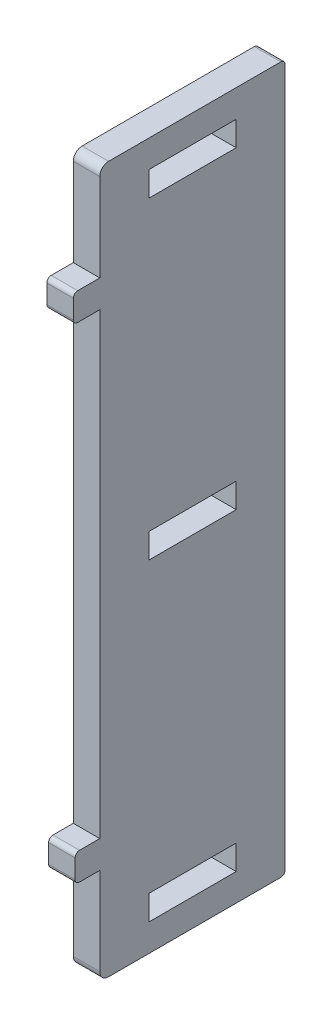
ISO-10303-21;
HEADER;
FILE_DESCRIPTION(('STEP AP214'),'2;1');
FILE_NAME('part.step','',(''),(''),'','','');
FILE_SCHEMA(('AUTOMOTIVE_DESIGN { 1 0 10303 214 1 1 1 1 }'));
ENDSEC;
DATA;
#1=APPLICATION_CONTEXT('core data for automotive mechanical design processes');
#2=APPLICATION_PROTOCOL_DEFINITION('international standard','automotive_design',2000,#1);
#3=PRODUCT_CONTEXT('',#1,'mechanical');
#4=PRODUCT('Part','Part','',(#3));
#5=PRODUCT_RELATED_PRODUCT_CATEGORY('part','',(#4));
#6=PRODUCT_DEFINITION_FORMATION('','',#4);
#7=PRODUCT_DEFINITION_CONTEXT('part definition',#1,'design');
#8=PRODUCT_DEFINITION('design','',#6,#7);
#9=PRODUCT_DEFINITION_SHAPE('','',#8);
#10=(LENGTH_UNIT() NAMED_UNIT(*) SI_UNIT(.MILLI.,.METRE.));
#11=(NAMED_UNIT(*) PLANE_ANGLE_UNIT() SI_UNIT($,.RADIAN.));
#12=(NAMED_UNIT(*) SI_UNIT($,.STERADIAN.) SOLID_ANGLE_UNIT());
#13=UNCERTAINTY_MEASURE_WITH_UNIT(LENGTH_MEASURE(1.E-05),#10,'distance_accuracy_value','');
#14=(GEOMETRIC_REPRESENTATION_CONTEXT(3) GLOBAL_UNCERTAINTY_ASSIGNED_CONTEXT((#13)) GLOBAL_UNIT_ASSIGNED_CONTEXT((#10,
#11,#12)) REPRESENTATION_CONTEXT('',''));
#15=CARTESIAN_POINT('',(0.,0.,0.));
#16=DIRECTION('',(0.,0.,1.));
#17=DIRECTION('',(1.,0.,0.));
#18=AXIS2_PLACEMENT_3D('',#15,#16,#17);
#19=CARTESIAN_POINT('',(3.,0.,13.3));
#20=DIRECTION('',(0.,0.,-1.));
#21=DIRECTION('',(0.,1.,0.));
#22=AXIS2_PLACEMENT_3D('',#19,#20,#21);
#23=PLANE('',#22);
#24=DIRECTION('',(0.,-1.,0.));
#25=VECTOR('',#24,1.);
#26=CARTESIAN_POINT('',(0.,0.,13.3));
#27=LINE('',#26,#25);
#28=CARTESIAN_POINT('',(0.,-26.44,13.3));
#29=VERTEX_POINT('',#28);
#30=CARTESIAN_POINT('',(0.,-28.56,13.3));
#31=VERTEX_POINT('',#30);
#32=EDGE_CURVE('E398',#29,#31,#27,.T.);
#33=ORIENTED_EDGE('',*,*,#32,.T.);
#34=DIRECTION('',(-1.,0.,0.));
#35=VECTOR('',#34,1.);
#36=CARTESIAN_POINT('',(3.,-28.56,13.3));
#37=LINE('',#36,#35);
#38=CARTESIAN_POINT('',(3.,-28.56,13.3));
#39=VERTEX_POINT('',#38);
#40=EDGE_CURVE('E55',#31,#39,#37,.F.);
#41=ORIENTED_EDGE('',*,*,#40,.T.);
#42=DIRECTION('',(0.,-1.,0.));
#43=VECTOR('',#42,1.);
#44=CARTESIAN_POINT('',(3.,0.,13.3));
#45=LINE('',#44,#43);
#46=CARTESIAN_POINT('',(3.,-26.44,13.3));
#47=VERTEX_POINT('',#46);
#48=EDGE_CURVE('E562',#47,#39,#45,.T.);
#49=ORIENTED_EDGE('',*,*,#48,.F.);
#50=DIRECTION('',(-1.,0.,0.));
#51=VECTOR('',#50,1.);
#52=CARTESIAN_POINT('',(0.,-26.44,13.3));
#53=LINE('',#52,#51);
#54=EDGE_CURVE('E608',#47,#29,#53,.T.);
#55=ORIENTED_EDGE('',*,*,#54,.T.);
#56=EDGE_LOOP('',(#33,#41,#49,#55));
#57=FACE_BOUND('',#56,.T.);
#58=ADVANCED_FACE('F46',(#57),#23,.F.);
#59=CARTESIAN_POINT('',(3.,-29.06,0.));
#60=DIRECTION('',(0.,1.,0.));
#61=DIRECTION('',(0.,0.,1.));
#62=AXIS2_PLACEMENT_3D('',#59,#60,#61);
#63=PLANE('',#62);
#64=DIRECTION('',(0.,0.,-1.));
#65=VECTOR('',#64,1.);
#66=CARTESIAN_POINT('',(3.,-29.06,0.));
#67=LINE('',#66,#65);
#68=CARTESIAN_POINT('',(3.,-29.06,12.8));
#69=VERTEX_POINT('',#68);
#70=CARTESIAN_POINT('',(3.,-29.06,10.5));
#71=VERTEX_POINT('',#70);
#72=EDGE_CURVE('E558',#69,#71,#67,.T.);
#73=ORIENTED_EDGE('',*,*,#72,.F.);
#74=DIRECTION('',(-1.,0.,0.));
#75=VECTOR('',#74,1.);
#76=CARTESIAN_POINT('',(3.,-29.06,12.8));
#77=LINE('',#76,#75);
#78=CARTESIAN_POINT('',(0.,-29.06,12.8));
#79=VERTEX_POINT('',#78);
#80=EDGE_CURVE('E604',#69,#79,#77,.T.);
#81=ORIENTED_EDGE('',*,*,#80,.T.);
#82=DIRECTION('',(0.,0.,-1.));
#83=VECTOR('',#82,1.);
#84=CARTESIAN_POINT('',(0.,-29.06,0.));
#85=LINE('',#84,#83);
#86=CARTESIAN_POINT('',(0.,-29.06,10.5));
#87=VERTEX_POINT('',#86);
#88=EDGE_CURVE('E401',#79,#87,#85,.T.);
#89=ORIENTED_EDGE('',*,*,#88,.T.);
#90=DIRECTION('',(-1.,0.,0.));
#91=VECTOR('',#90,1.);
#92=CARTESIAN_POINT('',(3.,-29.06,10.5));
#93=LINE('',#92,#91);
#94=EDGE_CURVE('E300',#71,#87,#93,.T.);
#95=ORIENTED_EDGE('',*,*,#94,.F.);
#96=EDGE_LOOP('',(#73,#81,#89,#95));
#97=FACE_BOUND('',#96,.T.);
#98=ADVANCED_FACE('F707',(#97),#63,.F.);
#99=CARTESIAN_POINT('',(3.,0.,10.5));
#100=DIRECTION('',(0.,0.,1.));
#101=DIRECTION('',(0.,-1.,0.));
#102=AXIS2_PLACEMENT_3D('',#99,#100,#101);
#103=PLANE('',#102);
#104=DIRECTION('',(0.,1.,0.));
#105=VECTOR('',#104,1.);
#106=CARTESIAN_POINT('',(0.,0.,10.5));
#107=LINE('',#106,#105);
#108=CARTESIAN_POINT('',(0.,-39.,10.5));
#109=VERTEX_POINT('',#108);
#110=EDGE_CURVE('E404',#109,#87,#107,.T.);
#111=ORIENTED_EDGE('',*,*,#110,.F.);
#112=DIRECTION('',(-1.,0.,0.));
#113=VECTOR('',#112,1.);
#114=CARTESIAN_POINT('',(3.,-39.,10.5));
#115=LINE('',#114,#113);
#116=CARTESIAN_POINT('',(3.,-39.,10.5));
#117=VERTEX_POINT('',#116);
#118=EDGE_CURVE('E306',#109,#117,#115,.F.);
#119=ORIENTED_EDGE('',*,*,#118,.T.);
#120=DIRECTION('',(0.,1.,0.));
#121=VECTOR('',#120,1.);
#122=CARTESIAN_POINT('',(3.,0.,10.5));
#123=LINE('',#122,#121);
#124=EDGE_CURVE('E561',#117,#71,#123,.T.);
#125=ORIENTED_EDGE('',*,*,#124,.T.);
#126=ORIENTED_EDGE('',*,*,#94,.T.);
#127=EDGE_LOOP('',(#111,#119,#125,#126));
#128=FACE_BOUND('',#127,.T.);
#129=ADVANCED_FACE('F713',(#128),#103,.T.);
#130=CARTESIAN_POINT('',(3.,-40.,0.));
#131=DIRECTION('',(0.,1.,0.));
#132=DIRECTION('',(0.,0.,1.));
#133=AXIS2_PLACEMENT_3D('',#130,#131,#132);
#134=PLANE('',#133);
#135=DIRECTION('',(0.,0.,-1.));
#136=VECTOR('',#135,1.);
#137=CARTESIAN_POINT('',(0.,-40.,0.));
#138=LINE('',#137,#136);
#139=CARTESIAN_POINT('',(0.,-40.,9.5));
#140=VERTEX_POINT('',#139);
#141=CARTESIAN_POINT('',(0.,-40.,-10.));
#142=VERTEX_POINT('',#141);
#143=EDGE_CURVE('E408',#140,#142,#138,.T.);
#144=ORIENTED_EDGE('',*,*,#143,.T.);
#145=DIRECTION('',(-1.,0.,0.));
#146=VECTOR('',#145,1.);
#147=CARTESIAN_POINT('',(3.,-40.,-10.));
#148=LINE('',#147,#146);
#149=CARTESIAN_POINT('',(3.,-40.,-10.));
#150=VERTEX_POINT('',#149);
#151=EDGE_CURVE('E585',#142,#150,#148,.F.);
#152=ORIENTED_EDGE('',*,*,#151,.T.);
#153=DIRECTION('',(0.,0.,-1.));
#154=VECTOR('',#153,1.);
#155=CARTESIAN_POINT('',(3.,-40.,0.));
#156=LINE('',#155,#154);
#157=CARTESIAN_POINT('',(3.,-40.,9.5));
#158=VERTEX_POINT('',#157);
#159=EDGE_CURVE('E569',#158,#150,#156,.T.);
#160=ORIENTED_EDGE('',*,*,#159,.F.);
#161=DIRECTION('',(-1.,0.,0.));
#162=VECTOR('',#161,1.);
#163=CARTESIAN_POINT('',(0.,-40.,9.5));
#164=LINE('',#163,#162);
#165=EDGE_CURVE('E295',#158,#140,#164,.T.);
#166=ORIENTED_EDGE('',*,*,#165,.T.);
#167=EDGE_LOOP('',(#144,#152,#160,#166));
#168=FACE_BOUND('',#167,.T.);
#169=ADVANCED_FACE('F721',(#168),#134,.F.);
#170=CARTESIAN_POINT('',(3.,0.,-10.5));
#171=DIRECTION('',(0.,0.,1.));
#172=DIRECTION('',(1.,0.,0.));
#173=AXIS2_PLACEMENT_3D('',#170,#171,#172);
#174=PLANE('',#173);
#175=DIRECTION('',(0.,1.,0.));
#176=VECTOR('',#175,1.);
#177=CARTESIAN_POINT('',(0.,0.,-10.5));
#178=LINE('',#177,#176);
#179=CARTESIAN_POINT('',(0.,-39.5,-10.5));
#180=VERTEX_POINT('',#179);
#181=CARTESIAN_POINT('',(0.,39.5,-10.5));
#182=VERTEX_POINT('',#181);
#183=EDGE_CURVE('E412',#180,#182,#178,.T.);
#184=ORIENTED_EDGE('',*,*,#183,.T.);
#185=DIRECTION('',(-1.,0.,0.));
#186=VECTOR('',#185,1.);
#187=CARTESIAN_POINT('',(3.,39.5,-10.5));
#188=LINE('',#187,#186);
#189=CARTESIAN_POINT('',(3.,39.5,-10.5));
#190=VERTEX_POINT('',#189);
#191=EDGE_CURVE('E539',#182,#190,#188,.F.);
#192=ORIENTED_EDGE('',*,*,#191,.T.);
#193=DIRECTION('',(0.,1.,0.));
#194=VECTOR('',#193,1.);
#195=CARTESIAN_POINT('',(3.,0.,-10.5));
#196=LINE('',#195,#194);
#197=CARTESIAN_POINT('',(3.,-39.5,-10.5));
#198=VERTEX_POINT('',#197);
#199=EDGE_CURVE('E573',#198,#190,#196,.T.);
#200=ORIENTED_EDGE('',*,*,#199,.F.);
#201=DIRECTION('',(-1.,0.,0.));
#202=VECTOR('',#201,1.);
#203=CARTESIAN_POINT('',(3.,-39.5,-10.5));
#204=LINE('',#203,#202);
#205=EDGE_CURVE('E535',#198,#180,#204,.T.);
#206=ORIENTED_EDGE('',*,*,#205,.T.);
#207=EDGE_LOOP('',(#184,#192,#200,#206));
#208=FACE_BOUND('',#207,.T.);
#209=ADVANCED_FACE('F729',(#208),#174,.F.);
#210=CARTESIAN_POINT('',(3.,40.,0.));
#211=DIRECTION('',(0.,1.,0.));
#212=DIRECTION('',(0.,0.,1.));
#213=AXIS2_PLACEMENT_3D('',#210,#211,#212);
#214=PLANE('',#213);
#215=DIRECTION('',(0.,0.,-1.));
#216=VECTOR('',#215,1.);
#217=CARTESIAN_POINT('',(3.,40.,0.));
#218=LINE('',#217,#216);
#219=CARTESIAN_POINT('',(3.,40.,9.5));
#220=VERTEX_POINT('',#219);
#221=CARTESIAN_POINT('',(3.,40.,-10.));
#222=VERTEX_POINT('',#221);
#223=EDGE_CURVE('E330',#220,#222,#218,.T.);
#224=ORIENTED_EDGE('',*,*,#223,.T.);
#225=DIRECTION('',(-1.,0.,0.));
#226=VECTOR('',#225,1.);
#227=CARTESIAN_POINT('',(0.,40.,-10.));
#228=LINE('',#227,#226);
#229=CARTESIAN_POINT('',(0.,40.,-10.));
#230=VERTEX_POINT('',#229);
#231=EDGE_CURVE('E505',#222,#230,#228,.T.);
#232=ORIENTED_EDGE('',*,*,#231,.T.);
#233=DIRECTION('',(0.,0.,-1.));
#234=VECTOR('',#233,1.);
#235=CARTESIAN_POINT('',(0.,40.,0.));
#236=LINE('',#235,#234);
#237=CARTESIAN_POINT('',(0.,40.,9.5));
#238=VERTEX_POINT('',#237);
#239=EDGE_CURVE('E416',#238,#230,#236,.T.);
#240=ORIENTED_EDGE('',*,*,#239,.F.);
#241=DIRECTION('',(-1.,0.,0.));
#242=VECTOR('',#241,1.);
#243=CARTESIAN_POINT('',(3.,40.,9.5));
#244=LINE('',#243,#242);
#245=EDGE_CURVE('E502',#238,#220,#244,.F.);
#246=ORIENTED_EDGE('',*,*,#245,.T.);
#247=EDGE_LOOP('',(#224,#232,#240,#246));
#248=FACE_BOUND('',#247,.T.);
#249=ADVANCED_FACE('F501',(#248),#214,.T.);
#250=CARTESIAN_POINT('',(3.,0.,10.5));
#251=DIRECTION('',(0.,0.,1.));
#252=DIRECTION('',(1.,0.,0.));
#253=AXIS2_PLACEMENT_3D('',#250,#251,#252);
#254=PLANE('',#253);
#255=DIRECTION('',(0.,1.,0.));
#256=VECTOR('',#255,1.);
#257=CARTESIAN_POINT('',(3.,0.,10.5));
#258=LINE('',#257,#256);
#259=CARTESIAN_POINT('',(3.,29.06,10.5));
#260=VERTEX_POINT('',#259);
#261=CARTESIAN_POINT('',(3.,39.,10.5));
#262=VERTEX_POINT('',#261);
#263=EDGE_CURVE('E325',#260,#262,#258,.T.);
#264=ORIENTED_EDGE('',*,*,#263,.T.);
#265=DIRECTION('',(-1.,0.,0.));
#266=VECTOR('',#265,1.);
#267=CARTESIAN_POINT('',(3.,39.,10.5));
#268=LINE('',#267,#266);
#269=CARTESIAN_POINT('',(0.,39.,10.5));
#270=VERTEX_POINT('',#269);
#271=EDGE_CURVE('E512',#262,#270,#268,.T.);
#272=ORIENTED_EDGE('',*,*,#271,.T.);
#273=DIRECTION('',(0.,1.,0.));
#274=VECTOR('',#273,1.);
#275=CARTESIAN_POINT('',(0.,0.,10.5));
#276=LINE('',#275,#274);
#277=CARTESIAN_POINT('',(0.,29.06,10.5));
#278=VERTEX_POINT('',#277);
#279=EDGE_CURVE('E420',#278,#270,#276,.T.);
#280=ORIENTED_EDGE('',*,*,#279,.F.);
#281=DIRECTION('',(-1.,0.,0.));
#282=VECTOR('',#281,1.);
#283=CARTESIAN_POINT('',(3.,29.06,10.5));
#284=LINE('',#283,#282);
#285=EDGE_CURVE('E446',#260,#278,#284,.T.);
#286=ORIENTED_EDGE('',*,*,#285,.F.);
#287=EDGE_LOOP('',(#264,#272,#280,#286));
#288=FACE_BOUND('',#287,.T.);
#289=ADVANCED_FACE('F638',(#288),#254,.T.);
#290=CARTESIAN_POINT('',(3.,29.06,0.));
#291=DIRECTION('',(0.,1.,0.));
#292=DIRECTION('',(0.,0.,1.));
#293=AXIS2_PLACEMENT_3D('',#290,#291,#292);
#294=PLANE('',#293);
#295=DIRECTION('',(0.,0.,-1.));
#296=VECTOR('',#295,1.);
#297=CARTESIAN_POINT('',(0.,29.06,0.));
#298=LINE('',#297,#296);
#299=CARTESIAN_POINT('',(0.,29.06,13.));
#300=VERTEX_POINT('',#299);
#301=EDGE_CURVE('E424',#300,#278,#298,.T.);
#302=ORIENTED_EDGE('',*,*,#301,.F.);
#303=DIRECTION('',(-1.,0.,0.));
#304=VECTOR('',#303,1.);
#305=CARTESIAN_POINT('',(3.,29.06,13.));
#306=LINE('',#305,#304);
#307=CARTESIAN_POINT('',(3.,29.06,13.));
#308=VERTEX_POINT('',#307);
#309=EDGE_CURVE('E601',#300,#308,#306,.F.);
#310=ORIENTED_EDGE('',*,*,#309,.T.);
#311=DIRECTION('',(0.,0.,-1.));
#312=VECTOR('',#311,1.);
#313=CARTESIAN_POINT('',(3.,29.06,0.));
#314=LINE('',#313,#312);
#315=EDGE_CURVE('E329',#308,#260,#314,.T.);
#316=ORIENTED_EDGE('',*,*,#315,.T.);
#317=ORIENTED_EDGE('',*,*,#285,.T.);
#318=EDGE_LOOP('',(#302,#310,#316,#317));
#319=FACE_BOUND('',#318,.T.);
#320=ADVANCED_FACE('F634',(#319),#294,.T.);
#321=CARTESIAN_POINT('',(3.,0.,13.5));
#322=DIRECTION('',(0.,0.,-1.));
#323=DIRECTION('',(-1.,0.,0.));
#324=AXIS2_PLACEMENT_3D('',#321,#322,#323);
#325=PLANE('',#324);
#326=DIRECTION('',(0.,-1.,0.));
#327=VECTOR('',#326,1.);
#328=CARTESIAN_POINT('',(0.,0.,13.5));
#329=LINE('',#328,#327);
#330=CARTESIAN_POINT('',(0.,28.56,13.5));
#331=VERTEX_POINT('',#330);
#332=CARTESIAN_POINT('',(0.,26.44,13.5));
#333=VERTEX_POINT('',#332);
#334=EDGE_CURVE('E428',#331,#333,#329,.T.);
#335=ORIENTED_EDGE('',*,*,#334,.T.);
#336=DIRECTION('',(-1.,0.,0.));
#337=VECTOR('',#336,1.);
#338=CARTESIAN_POINT('',(3.,26.44,13.5));
#339=LINE('',#338,#337);
#340=CARTESIAN_POINT('',(3.,26.44,13.5));
#341=VERTEX_POINT('',#340);
#342=EDGE_CURVE('E598',#333,#341,#339,.F.);
#343=ORIENTED_EDGE('',*,*,#342,.T.);
#344=DIRECTION('',(0.,-1.,0.));
#345=VECTOR('',#344,1.);
#346=CARTESIAN_POINT('',(3.,0.,13.5));
#347=LINE('',#346,#345);
#348=CARTESIAN_POINT('',(3.,28.56,13.5));
#349=VERTEX_POINT('',#348);
#350=EDGE_CURVE('E620',#349,#341,#347,.T.);
#351=ORIENTED_EDGE('',*,*,#350,.F.);
#352=DIRECTION('',(-1.,0.,0.));
#353=VECTOR('',#352,1.);
#354=CARTESIAN_POINT('',(0.,28.56,13.5));
#355=LINE('',#354,#353);
#356=EDGE_CURVE('E594',#349,#331,#355,.T.);
#357=ORIENTED_EDGE('',*,*,#356,.T.);
#358=EDGE_LOOP('',(#335,#343,#351,#357));
#359=FACE_BOUND('',#358,.T.);
#360=ADVANCED_FACE('F627',(#359),#325,.F.);
#361=CARTESIAN_POINT('',(3.,25.94,0.));
#362=DIRECTION('',(0.,1.,0.));
#363=DIRECTION('',(0.,0.,1.));
#364=AXIS2_PLACEMENT_3D('',#361,#362,#363);
#365=PLANE('',#364);
#366=DIRECTION('',(0.,0.,-1.));
#367=VECTOR('',#366,1.);
#368=CARTESIAN_POINT('',(3.,25.94,0.));
#369=LINE('',#368,#367);
#370=CARTESIAN_POINT('',(3.,25.94,13.));
#371=VERTEX_POINT('',#370);
#372=CARTESIAN_POINT('',(3.,25.94,10.5));
#373=VERTEX_POINT('',#372);
#374=EDGE_CURVE('E351',#371,#373,#369,.T.);
#375=ORIENTED_EDGE('',*,*,#374,.F.);
#376=DIRECTION('',(-1.,0.,0.));
#377=VECTOR('',#376,1.);
#378=CARTESIAN_POINT('',(3.,25.94,13.));
#379=LINE('',#378,#377);
#380=CARTESIAN_POINT('',(0.,25.94,13.));
#381=VERTEX_POINT('',#380);
#382=EDGE_CURVE('E590',#371,#381,#379,.T.);
#383=ORIENTED_EDGE('',*,*,#382,.T.);
#384=DIRECTION('',(0.,0.,-1.));
#385=VECTOR('',#384,1.);
#386=CARTESIAN_POINT('',(0.,25.94,0.));
#387=LINE('',#386,#385);
#388=CARTESIAN_POINT('',(0.,25.94,10.5));
#389=VERTEX_POINT('',#388);
#390=EDGE_CURVE('E432',#381,#389,#387,.T.);
#391=ORIENTED_EDGE('',*,*,#390,.T.);
#392=DIRECTION('',(-1.,0.,0.));
#393=VECTOR('',#392,1.);
#394=CARTESIAN_POINT('',(3.,25.94,10.5));
#395=LINE('',#394,#393);
#396=EDGE_CURVE('E441',#373,#389,#395,.T.);
#397=ORIENTED_EDGE('',*,*,#396,.F.);
#398=EDGE_LOOP('',(#375,#383,#391,#397));
#399=FACE_BOUND('',#398,.T.);
#400=ADVANCED_FACE('F689',(#399),#365,.F.);
#401=CARTESIAN_POINT('',(0.,-25.94,10.5));
#402=VERTEX_POINT('',#401);
#403=EDGE_CURVE('E425',#402,#389,#276,.T.);
#404=ORIENTED_EDGE('',*,*,#403,.F.);
#405=DIRECTION('',(-1.,0.,0.));
#406=VECTOR('',#405,1.);
#407=CARTESIAN_POINT('',(3.,-25.94,10.5));
#408=LINE('',#407,#406);
#409=CARTESIAN_POINT('',(3.,-25.94,10.5));
#410=VERTEX_POINT('',#409);
#411=EDGE_CURVE('E437',#410,#402,#408,.T.);
#412=ORIENTED_EDGE('',*,*,#411,.F.);
#413=EDGE_CURVE('E331',#410,#373,#258,.T.);
#414=ORIENTED_EDGE('',*,*,#413,.T.);
#415=ORIENTED_EDGE('',*,*,#396,.T.);
#416=EDGE_LOOP('',(#404,#412,#414,#415));
#417=FACE_BOUND('',#416,.T.);
#418=ADVANCED_FACE('F683',(#417),#254,.T.);
#419=CARTESIAN_POINT('',(3.,-34.1,0.));
#420=DIRECTION('',(0.,1.,0.));
#421=DIRECTION('',(0.,0.,1.));
#422=AXIS2_PLACEMENT_3D('',#419,#420,#421);
#423=PLANE('',#422);
#424=DIRECTION('',(0.,0.,-1.));
#425=VECTOR('',#424,1.);
#426=CARTESIAN_POINT('',(0.,-34.1,0.));
#427=LINE('',#426,#425);
#428=CARTESIAN_POINT('',(0.,-34.1,4.95));
#429=VERTEX_POINT('',#428);
#430=CARTESIAN_POINT('',(0.,-34.1,-4.95));
#431=VERTEX_POINT('',#430);
#432=EDGE_CURVE('E382',#429,#431,#427,.T.);
#433=ORIENTED_EDGE('',*,*,#432,.T.);
#434=DIRECTION('',(-1.,0.,0.));
#435=VECTOR('',#434,1.);
#436=CARTESIAN_POINT('',(3.,-34.1,-4.95));
#437=LINE('',#436,#435);
#438=CARTESIAN_POINT('',(3.,-34.1,-4.95));
#439=VERTEX_POINT('',#438);
#440=EDGE_CURVE('E442',#439,#431,#437,.T.);
#441=ORIENTED_EDGE('',*,*,#440,.F.);
#442=DIRECTION('',(0.,0.,-1.));
#443=VECTOR('',#442,1.);
#444=CARTESIAN_POINT('',(3.,-34.1,0.));
#445=LINE('',#444,#443);
#446=CARTESIAN_POINT('',(3.,-34.1,4.95));
#447=VERTEX_POINT('',#446);
#448=EDGE_CURVE('E653',#447,#439,#445,.T.);
#449=ORIENTED_EDGE('',*,*,#448,.F.);
#450=DIRECTION('',(-1.,0.,0.));
#451=VECTOR('',#450,1.);
#452=CARTESIAN_POINT('',(3.,-34.1,4.95));
#453=LINE('',#452,#451);
#454=EDGE_CURVE('E453',#447,#429,#453,.T.);
#455=ORIENTED_EDGE('',*,*,#454,.T.);
#456=EDGE_LOOP('',(#433,#441,#449,#455));
#457=FACE_BOUND('',#456,.T.);
#458=ADVANCED_FACE('F762',(#457),#423,.F.);
#459=CARTESIAN_POINT('',(3.,0.,-4.95));
#460=DIRECTION('',(0.,0.,-1.));
#461=DIRECTION('',(-1.,0.,0.));
#462=AXIS2_PLACEMENT_3D('',#459,#460,#461);
#463=PLANE('',#462);
#464=DIRECTION('',(0.,-1.,0.));
#465=VECTOR('',#464,1.);
#466=CARTESIAN_POINT('',(0.,0.,-4.95));
#467=LINE('',#466,#465);
#468=CARTESIAN_POINT('',(0.,-36.9,-4.95));
#469=VERTEX_POINT('',#468);
#470=EDGE_CURVE('E386',#431,#469,#467,.T.);
#471=ORIENTED_EDGE('',*,*,#470,.T.);
#472=DIRECTION('',(-1.,0.,0.));
#473=VECTOR('',#472,1.);
#474=CARTESIAN_POINT('',(3.,-36.9,-4.95));
#475=LINE('',#474,#473);
#476=CARTESIAN_POINT('',(3.,-36.9,-4.95));
#477=VERTEX_POINT('',#476);
#478=EDGE_CURVE('E460',#477,#469,#475,.T.);
#479=ORIENTED_EDGE('',*,*,#478,.F.);
#480=DIRECTION('',(0.,-1.,0.));
#481=VECTOR('',#480,1.);
#482=CARTESIAN_POINT('',(3.,0.,-4.95));
#483=LINE('',#482,#481);
#484=EDGE_CURVE('E650',#439,#477,#483,.T.);
#485=ORIENTED_EDGE('',*,*,#484,.F.);
#486=ORIENTED_EDGE('',*,*,#440,.T.);
#487=EDGE_LOOP('',(#471,#479,#485,#486));
#488=FACE_BOUND('',#487,.T.);
#489=ADVANCED_FACE('F758',(#488),#463,.F.);
#490=CARTESIAN_POINT('',(3.,-36.9,0.));
#491=DIRECTION('',(0.,1.,0.));
#492=DIRECTION('',(0.,0.,1.));
#493=AXIS2_PLACEMENT_3D('',#490,#491,#492);
#494=PLANE('',#493);
#495=DIRECTION('',(0.,0.,-1.));
#496=VECTOR('',#495,1.);
#497=CARTESIAN_POINT('',(0.,-36.9,0.));
#498=LINE('',#497,#496);
#499=CARTESIAN_POINT('',(0.,-36.9,4.95));
#500=VERTEX_POINT('',#499);
#501=EDGE_CURVE('E390',#500,#469,#498,.T.);
#502=ORIENTED_EDGE('',*,*,#501,.F.);
#503=DIRECTION('',(-1.,0.,0.));
#504=VECTOR('',#503,1.);
#505=CARTESIAN_POINT('',(3.,-36.9,4.95));
#506=LINE('',#505,#504);
#507=CARTESIAN_POINT('',(3.,-36.9,4.95));
#508=VERTEX_POINT('',#507);
#509=EDGE_CURVE('E456',#508,#500,#506,.T.);
#510=ORIENTED_EDGE('',*,*,#509,.F.);
#511=DIRECTION('',(0.,0.,-1.));
#512=VECTOR('',#511,1.);
#513=CARTESIAN_POINT('',(3.,-36.9,0.));
#514=LINE('',#513,#512);
#515=EDGE_CURVE('E647',#508,#477,#514,.T.);
#516=ORIENTED_EDGE('',*,*,#515,.T.);
#517=ORIENTED_EDGE('',*,*,#478,.T.);
#518=EDGE_LOOP('',(#502,#510,#516,#517));
#519=FACE_BOUND('',#518,.T.);
#520=ADVANCED_FACE('F754',(#519),#494,.T.);
#521=CARTESIAN_POINT('',(3.,1.4,0.));
#522=DIRECTION('',(0.,1.,0.));
#523=DIRECTION('',(0.,0.,1.));
#524=AXIS2_PLACEMENT_3D('',#521,#522,#523);
#525=PLANE('',#524);
#526=DIRECTION('',(0.,0.,-1.));
#527=VECTOR('',#526,1.);
#528=CARTESIAN_POINT('',(0.,1.4,0.));
#529=LINE('',#528,#527);
#530=CARTESIAN_POINT('',(0.,1.4,4.95));
#531=VERTEX_POINT('',#530);
#532=CARTESIAN_POINT('',(0.,1.4,-4.95));
#533=VERTEX_POINT('',#532);
#534=EDGE_CURVE('E366',#531,#533,#529,.T.);
#535=ORIENTED_EDGE('',*,*,#534,.T.);
#536=DIRECTION('',(-1.,0.,0.));
#537=VECTOR('',#536,1.);
#538=CARTESIAN_POINT('',(3.,1.4,-4.95));
#539=LINE('',#538,#537);
#540=CARTESIAN_POINT('',(3.,1.4,-4.95));
#541=VERTEX_POINT('',#540);
#542=EDGE_CURVE('E457',#541,#533,#539,.T.);
#543=ORIENTED_EDGE('',*,*,#542,.F.);
#544=DIRECTION('',(0.,0.,-1.));
#545=VECTOR('',#544,1.);
#546=CARTESIAN_POINT('',(3.,1.4,0.));
#547=LINE('',#546,#545);
#548=CARTESIAN_POINT('',(3.,1.4,4.95));
#549=VERTEX_POINT('',#548);
#550=EDGE_CURVE('E668',#549,#541,#547,.T.);
#551=ORIENTED_EDGE('',*,*,#550,.F.);
#552=DIRECTION('',(-1.,0.,0.));
#553=VECTOR('',#552,1.);
#554=CARTESIAN_POINT('',(3.,1.4,4.95));
#555=LINE('',#554,#553);
#556=EDGE_CURVE('E285',#549,#531,#555,.T.);
#557=ORIENTED_EDGE('',*,*,#556,.T.);
#558=EDGE_LOOP('',(#535,#543,#551,#557));
#559=FACE_BOUND('',#558,.T.);
#560=ADVANCED_FACE('F757',(#559),#525,.F.);
#561=CARTESIAN_POINT('',(3.,0.,-4.95));
#562=DIRECTION('',(0.,0.,-1.));
#563=DIRECTION('',(-1.,0.,0.));
#564=AXIS2_PLACEMENT_3D('',#561,#562,#563);
#565=PLANE('',#564);
#566=DIRECTION('',(0.,-1.,0.));
#567=VECTOR('',#566,1.);
#568=CARTESIAN_POINT('',(0.,0.,-4.95));
#569=LINE('',#568,#567);
#570=CARTESIAN_POINT('',(0.,-1.4,-4.95));
#571=VERTEX_POINT('',#570);
#572=EDGE_CURVE('E370',#533,#571,#569,.T.);
#573=ORIENTED_EDGE('',*,*,#572,.T.);
#574=DIRECTION('',(-1.,0.,0.));
#575=VECTOR('',#574,1.);
#576=CARTESIAN_POINT('',(3.,-1.4,-4.95));
#577=LINE('',#576,#575);
#578=CARTESIAN_POINT('',(3.,-1.4,-4.95));
#579=VERTEX_POINT('',#578);
#580=EDGE_CURVE('E468',#579,#571,#577,.T.);
#581=ORIENTED_EDGE('',*,*,#580,.F.);
#582=DIRECTION('',(0.,-1.,0.));
#583=VECTOR('',#582,1.);
#584=CARTESIAN_POINT('',(3.,0.,-4.95));
#585=LINE('',#584,#583);
#586=EDGE_CURVE('E665',#541,#579,#585,.T.);
#587=ORIENTED_EDGE('',*,*,#586,.F.);
#588=ORIENTED_EDGE('',*,*,#542,.T.);
#589=EDGE_LOOP('',(#573,#581,#587,#588));
#590=FACE_BOUND('',#589,.T.);
#591=ADVANCED_FACE('F773',(#590),#565,.F.);
#592=CARTESIAN_POINT('',(3.,-1.4,0.));
#593=DIRECTION('',(0.,1.,0.));
#594=DIRECTION('',(0.,0.,1.));
#595=AXIS2_PLACEMENT_3D('',#592,#593,#594);
#596=PLANE('',#595);
#597=DIRECTION('',(0.,0.,-1.));
#598=VECTOR('',#597,1.);
#599=CARTESIAN_POINT('',(0.,-1.4,0.));
#600=LINE('',#599,#598);
#601=CARTESIAN_POINT('',(0.,-1.4,4.95));
#602=VERTEX_POINT('',#601);
#603=EDGE_CURVE('E374',#602,#571,#600,.T.);
#604=ORIENTED_EDGE('',*,*,#603,.F.);
#605=DIRECTION('',(-1.,0.,0.));
#606=VECTOR('',#605,1.);
#607=CARTESIAN_POINT('',(3.,-1.4,4.95));
#608=LINE('',#607,#606);
#609=CARTESIAN_POINT('',(3.,-1.4,4.95));
#610=VERTEX_POINT('',#609);
#611=EDGE_CURVE('E289',#610,#602,#608,.T.);
#612=ORIENTED_EDGE('',*,*,#611,.F.);
#613=DIRECTION('',(0.,0.,-1.));
#614=VECTOR('',#613,1.);
#615=CARTESIAN_POINT('',(3.,-1.4,0.));
#616=LINE('',#615,#614);
#617=EDGE_CURVE('E661',#610,#579,#616,.T.);
#618=ORIENTED_EDGE('',*,*,#617,.T.);
#619=ORIENTED_EDGE('',*,*,#580,.T.);
#620=EDGE_LOOP('',(#604,#612,#618,#619));
#621=FACE_BOUND('',#620,.T.);
#622=ADVANCED_FACE('F770',(#621),#596,.T.);
#623=CARTESIAN_POINT('',(3.,36.9,0.));
#624=DIRECTION('',(0.,1.,0.));
#625=DIRECTION('',(0.,0.,1.));
#626=AXIS2_PLACEMENT_3D('',#623,#624,#625);
#627=PLANE('',#626);
#628=DIRECTION('',(0.,0.,-1.));
#629=VECTOR('',#628,1.);
#630=CARTESIAN_POINT('',(0.,36.9,0.));
#631=LINE('',#630,#629);
#632=CARTESIAN_POINT('',(0.,36.9,4.95));
#633=VERTEX_POINT('',#632);
#634=CARTESIAN_POINT('',(0.,36.9,-4.95));
#635=VERTEX_POINT('',#634);
#636=EDGE_CURVE('E283',#633,#635,#631,.T.);
#637=ORIENTED_EDGE('',*,*,#636,.T.);
#638=DIRECTION('',(-1.,0.,0.));
#639=VECTOR('',#638,1.);
#640=CARTESIAN_POINT('',(3.,36.9,-4.95));
#641=LINE('',#640,#639);
#642=CARTESIAN_POINT('',(3.,36.9,-4.95));
#643=VERTEX_POINT('',#642);
#644=EDGE_CURVE('E261',#643,#635,#641,.T.);
#645=ORIENTED_EDGE('',*,*,#644,.F.);
#646=DIRECTION('',(0.,0.,-1.));
#647=VECTOR('',#646,1.);
#648=CARTESIAN_POINT('',(3.,36.9,0.));
#649=LINE('',#648,#647);
#650=CARTESIAN_POINT('',(3.,36.9,4.95));
#651=VERTEX_POINT('',#650);
#652=EDGE_CURVE('E269',#651,#643,#649,.T.);
#653=ORIENTED_EDGE('',*,*,#652,.F.);
#654=DIRECTION('',(-1.,0.,0.));
#655=VECTOR('',#654,1.);
#656=CARTESIAN_POINT('',(3.,36.9,4.95));
#657=LINE('',#656,#655);
#658=EDGE_CURVE('E350',#651,#633,#657,.T.);
#659=ORIENTED_EDGE('',*,*,#658,.T.);
#660=EDGE_LOOP('',(#637,#645,#653,#659));
#661=FACE_BOUND('',#660,.T.);
#662=ADVANCED_FACE('F281',(#661),#627,.F.);
#663=CARTESIAN_POINT('',(3.,0.,-4.95));
#664=DIRECTION('',(0.,0.,-1.));
#665=DIRECTION('',(-1.,0.,0.));
#666=AXIS2_PLACEMENT_3D('',#663,#664,#665);
#667=PLANE('',#666);
#668=DIRECTION('',(0.,-1.,0.));
#669=VECTOR('',#668,1.);
#670=CARTESIAN_POINT('',(0.,0.,-4.95));
#671=LINE('',#670,#669);
#672=CARTESIAN_POINT('',(0.,34.1,-4.95));
#673=VERTEX_POINT('',#672);
#674=EDGE_CURVE('E355',#635,#673,#671,.T.);
#675=ORIENTED_EDGE('',*,*,#674,.T.);
#676=DIRECTION('',(-1.,0.,0.));
#677=VECTOR('',#676,1.);
#678=CARTESIAN_POINT('',(3.,34.1,-4.95));
#679=LINE('',#678,#677);
#680=CARTESIAN_POINT('',(3.,34.1,-4.95));
#681=VERTEX_POINT('',#680);
#682=EDGE_CURVE('E263',#681,#673,#679,.T.);
#683=ORIENTED_EDGE('',*,*,#682,.F.);
#684=DIRECTION('',(0.,-1.,0.));
#685=VECTOR('',#684,1.);
#686=CARTESIAN_POINT('',(3.,0.,-4.95));
#687=LINE('',#686,#685);
#688=EDGE_CURVE('E256',#643,#681,#687,.T.);
#689=ORIENTED_EDGE('',*,*,#688,.F.);
#690=ORIENTED_EDGE('',*,*,#644,.T.);
#691=EDGE_LOOP('',(#675,#683,#689,#690));
#692=FACE_BOUND('',#691,.T.);
#693=ADVANCED_FACE('F259',(#692),#667,.F.);
#694=CARTESIAN_POINT('',(3.,34.1,0.));
#695=DIRECTION('',(0.,1.,0.));
#696=DIRECTION('',(0.,0.,1.));
#697=AXIS2_PLACEMENT_3D('',#694,#695,#696);
#698=PLANE('',#697);
#699=DIRECTION('',(0.,0.,-1.));
#700=VECTOR('',#699,1.);
#701=CARTESIAN_POINT('',(0.,34.1,0.));
#702=LINE('',#701,#700);
#703=CARTESIAN_POINT('',(0.,34.1,4.95));
#704=VERTEX_POINT('',#703);
#705=EDGE_CURVE('E358',#704,#673,#702,.T.);
#706=ORIENTED_EDGE('',*,*,#705,.F.);
#707=DIRECTION('',(-1.,0.,0.));
#708=VECTOR('',#707,1.);
#709=CARTESIAN_POINT('',(3.,34.1,4.95));
#710=LINE('',#709,#708);
#711=CARTESIAN_POINT('',(3.,34.1,4.95));
#712=VERTEX_POINT('',#711);
#713=EDGE_CURVE('E291',#712,#704,#710,.T.);
#714=ORIENTED_EDGE('',*,*,#713,.F.);
#715=DIRECTION('',(0.,0.,-1.));
#716=VECTOR('',#715,1.);
#717=CARTESIAN_POINT('',(3.,34.1,0.));
#718=LINE('',#717,#716);
#719=EDGE_CURVE('E268',#712,#681,#718,.T.);
#720=ORIENTED_EDGE('',*,*,#719,.T.);
#721=ORIENTED_EDGE('',*,*,#682,.T.);
#722=EDGE_LOOP('',(#706,#714,#720,#721));
#723=FACE_BOUND('',#722,.T.);
#724=ADVANCED_FACE('F481',(#723),#698,.T.);
#725=CARTESIAN_POINT('',(3.,0.,4.95));
#726=DIRECTION('',(0.,0.,-1.));
#727=DIRECTION('',(-1.,0.,0.));
#728=AXIS2_PLACEMENT_3D('',#725,#726,#727);
#729=PLANE('',#728);
#730=DIRECTION('',(0.,-1.,0.));
#731=VECTOR('',#730,1.);
#732=CARTESIAN_POINT('',(0.,0.,4.95));
#733=LINE('',#732,#731);
#734=EDGE_CURVE('E394',#429,#500,#733,.T.);
#735=ORIENTED_EDGE('',*,*,#734,.F.);
#736=ORIENTED_EDGE('',*,*,#454,.F.);
#737=DIRECTION('',(0.,-1.,0.));
#738=VECTOR('',#737,1.);
#739=CARTESIAN_POINT('',(3.,0.,4.95));
#740=LINE('',#739,#738);
#741=EDGE_CURVE('E644',#447,#508,#740,.T.);
#742=ORIENTED_EDGE('',*,*,#741,.T.);
#743=ORIENTED_EDGE('',*,*,#509,.T.);
#744=EDGE_LOOP('',(#735,#736,#742,#743));
#745=FACE_BOUND('',#744,.T.);
#746=ADVANCED_FACE('F749',(#745),#729,.T.);
#747=CARTESIAN_POINT('',(3.,0.,4.95));
#748=DIRECTION('',(0.,0.,-1.));
#749=DIRECTION('',(-1.,0.,0.));
#750=AXIS2_PLACEMENT_3D('',#747,#748,#749);
#751=PLANE('',#750);
#752=DIRECTION('',(0.,-1.,0.));
#753=VECTOR('',#752,1.);
#754=CARTESIAN_POINT('',(0.,0.,4.95));
#755=LINE('',#754,#753);
#756=EDGE_CURVE('E378',#531,#602,#755,.T.);
#757=ORIENTED_EDGE('',*,*,#756,.F.);
#758=ORIENTED_EDGE('',*,*,#556,.F.);
#759=DIRECTION('',(0.,-1.,0.));
#760=VECTOR('',#759,1.);
#761=CARTESIAN_POINT('',(3.,0.,4.95));
#762=LINE('',#761,#760);
#763=EDGE_CURVE('E657',#549,#610,#762,.T.);
#764=ORIENTED_EDGE('',*,*,#763,.T.);
#765=ORIENTED_EDGE('',*,*,#611,.T.);
#766=EDGE_LOOP('',(#757,#758,#764,#765));
#767=FACE_BOUND('',#766,.T.);
#768=ADVANCED_FACE('F752',(#767),#751,.T.);
#769=CARTESIAN_POINT('',(3.,0.,4.95));
#770=DIRECTION('',(0.,0.,-1.));
#771=DIRECTION('',(-1.,0.,0.));
#772=AXIS2_PLACEMENT_3D('',#769,#770,#771);
#773=PLANE('',#772);
#774=DIRECTION('',(0.,-1.,0.));
#775=VECTOR('',#774,1.);
#776=CARTESIAN_POINT('',(0.,0.,4.95));
#777=LINE('',#776,#775);
#778=EDGE_CURVE('E362',#633,#704,#777,.T.);
#779=ORIENTED_EDGE('',*,*,#778,.F.);
#780=ORIENTED_EDGE('',*,*,#658,.F.);
#781=DIRECTION('',(0.,-1.,0.));
#782=VECTOR('',#781,1.);
#783=CARTESIAN_POINT('',(3.,0.,4.95));
#784=LINE('',#783,#782);
#785=EDGE_CURVE('E276',#651,#712,#784,.T.);
#786=ORIENTED_EDGE('',*,*,#785,.T.);
#787=ORIENTED_EDGE('',*,*,#713,.T.);
#788=EDGE_LOOP('',(#779,#780,#786,#787));
#789=FACE_BOUND('',#788,.T.);
#790=ADVANCED_FACE('F479',(#789),#773,.T.);
#791=CARTESIAN_POINT('',(3.,-25.94,0.));
#792=DIRECTION('',(0.,1.,0.));
#793=DIRECTION('',(0.,0.,1.));
#794=AXIS2_PLACEMENT_3D('',#791,#792,#793);
#795=PLANE('',#794);
#796=DIRECTION('',(0.,0.,-1.));
#797=VECTOR('',#796,1.);
#798=CARTESIAN_POINT('',(0.,-25.94,0.));
#799=LINE('',#798,#797);
#800=CARTESIAN_POINT('',(0.,-25.94,12.8));
#801=VERTEX_POINT('',#800);
#802=EDGE_CURVE('E279',#801,#402,#799,.T.);
#803=ORIENTED_EDGE('',*,*,#802,.F.);
#804=DIRECTION('',(-1.,0.,0.));
#805=VECTOR('',#804,1.);
#806=CARTESIAN_POINT('',(3.,-25.94,12.8));
#807=LINE('',#806,#805);
#808=CARTESIAN_POINT('',(3.,-25.94,12.8));
#809=VERTEX_POINT('',#808);
#810=EDGE_CURVE('E12',#801,#809,#807,.F.);
#811=ORIENTED_EDGE('',*,*,#810,.T.);
#812=DIRECTION('',(0.,0.,-1.));
#813=VECTOR('',#812,1.);
#814=CARTESIAN_POINT('',(3.,-25.94,0.));
#815=LINE('',#814,#813);
#816=EDGE_CURVE('E346',#809,#410,#815,.T.);
#817=ORIENTED_EDGE('',*,*,#816,.T.);
#818=ORIENTED_EDGE('',*,*,#411,.T.);
#819=EDGE_LOOP('',(#803,#811,#817,#818));
#820=FACE_BOUND('',#819,.T.);
#821=ADVANCED_FACE('F783',(#820),#795,.T.);
#822=CARTESIAN_POINT('',(3.,0.,0.));
#823=DIRECTION('',(1.,0.,0.));
#824=DIRECTION('',(0.,0.,-1.));
#825=AXIS2_PLACEMENT_3D('',#822,#823,#824);
#826=PLANE('',#825);
#827=ORIENTED_EDGE('',*,*,#652,.T.);
#828=ORIENTED_EDGE('',*,*,#688,.T.);
#829=ORIENTED_EDGE('',*,*,#719,.F.);
#830=ORIENTED_EDGE('',*,*,#785,.F.);
#831=EDGE_LOOP('',(#827,#828,#829,#830));
#832=FACE_BOUND('',#831,.T.);
#833=ORIENTED_EDGE('',*,*,#550,.T.);
#834=ORIENTED_EDGE('',*,*,#586,.T.);
#835=ORIENTED_EDGE('',*,*,#617,.F.);
#836=ORIENTED_EDGE('',*,*,#763,.F.);
#837=EDGE_LOOP('',(#833,#834,#835,#836));
#838=FACE_BOUND('',#837,.T.);
#839=ORIENTED_EDGE('',*,*,#448,.T.);
#840=ORIENTED_EDGE('',*,*,#484,.T.);
#841=ORIENTED_EDGE('',*,*,#515,.F.);
#842=ORIENTED_EDGE('',*,*,#741,.F.);
#843=EDGE_LOOP('',(#839,#840,#841,#842));
#844=FACE_BOUND('',#843,.T.);
#845=ORIENTED_EDGE('',*,*,#199,.T.);
#846=CARTESIAN_POINT('',(3.,39.5,-10.));
#847=DIRECTION('',(1.,0.,0.));
#848=DIRECTION('',(0.,0.,-1.));
#849=AXIS2_PLACEMENT_3D('',#846,#847,#848);
#850=CIRCLE('',#849,0.5);
#851=EDGE_CURVE('E581',#190,#222,#850,.T.);
#852=ORIENTED_EDGE('',*,*,#851,.T.);
#853=ORIENTED_EDGE('',*,*,#223,.F.);
#854=CARTESIAN_POINT('',(3.,39.,9.5));
#855=DIRECTION('',(1.,0.,0.));
#856=DIRECTION('',(0.,0.,-1.));
#857=AXIS2_PLACEMENT_3D('',#854,#855,#856);
#858=CIRCLE('',#857,1.);
#859=EDGE_CURVE('E309',#220,#262,#858,.T.);
#860=ORIENTED_EDGE('',*,*,#859,.T.);
#861=ORIENTED_EDGE('',*,*,#263,.F.);
#862=ORIENTED_EDGE('',*,*,#315,.F.);
#863=CARTESIAN_POINT('',(3.,28.56,13.));
#864=DIRECTION('',(1.,0.,0.));
#865=DIRECTION('',(0.,0.,-1.));
#866=AXIS2_PLACEMENT_3D('',#863,#864,#865);
#867=CIRCLE('',#866,0.5);
#868=EDGE_CURVE('E548',#308,#349,#867,.T.);
#869=ORIENTED_EDGE('',*,*,#868,.T.);
#870=ORIENTED_EDGE('',*,*,#350,.T.);
#871=CARTESIAN_POINT('',(3.,26.44,13.));
#872=DIRECTION('',(1.,0.,0.));
#873=DIRECTION('',(0.,0.,-1.));
#874=AXIS2_PLACEMENT_3D('',#871,#872,#873);
#875=CIRCLE('',#874,0.5);
#876=EDGE_CURVE('E614',#341,#371,#875,.T.);
#877=ORIENTED_EDGE('',*,*,#876,.T.);
#878=ORIENTED_EDGE('',*,*,#374,.T.);
#879=ORIENTED_EDGE('',*,*,#413,.F.);
#880=ORIENTED_EDGE('',*,*,#816,.F.);
#881=CARTESIAN_POINT('',(3.,-26.44,12.8));
#882=DIRECTION('',(1.,0.,0.));
#883=DIRECTION('',(0.,0.,-1.));
#884=AXIS2_PLACEMENT_3D('',#881,#882,#883);
#885=CIRCLE('',#884,0.5);
#886=EDGE_CURVE('E541',#809,#47,#885,.T.);
#887=ORIENTED_EDGE('',*,*,#886,.T.);
#888=ORIENTED_EDGE('',*,*,#48,.T.);
#889=CARTESIAN_POINT('',(3.,-28.56,12.8));
#890=DIRECTION('',(1.,0.,0.));
#891=DIRECTION('',(0.,0.,-1.));
#892=AXIS2_PLACEMENT_3D('',#889,#890,#891);
#893=CIRCLE('',#892,0.5);
#894=EDGE_CURVE('E62',#39,#69,#893,.T.);
#895=ORIENTED_EDGE('',*,*,#894,.T.);
#896=ORIENTED_EDGE('',*,*,#72,.T.);
#897=ORIENTED_EDGE('',*,*,#124,.F.);
#898=CARTESIAN_POINT('',(3.,-39.,9.5));
#899=DIRECTION('',(1.,0.,0.));
#900=DIRECTION('',(0.,0.,-1.));
#901=AXIS2_PLACEMENT_3D('',#898,#899,#900);
#902=CIRCLE('',#901,1.);
#903=EDGE_CURVE('E313',#117,#158,#902,.T.);
#904=ORIENTED_EDGE('',*,*,#903,.T.);
#905=ORIENTED_EDGE('',*,*,#159,.T.);
#906=CARTESIAN_POINT('',(3.,-39.5,-10.));
#907=DIRECTION('',(1.,0.,0.));
#908=DIRECTION('',(0.,0.,-1.));
#909=AXIS2_PLACEMENT_3D('',#906,#907,#908);
#910=CIRCLE('',#909,0.5);
#911=EDGE_CURVE('E586',#150,#198,#910,.T.);
#912=ORIENTED_EDGE('',*,*,#911,.T.);
#913=EDGE_LOOP('',(#845,#852,#853,#860,#861,#862,#869,#870,#877,#878,#879,#880,#887,#888,#895,
#896,#897,#904,#905,#912));
#914=FACE_BOUND('',#913,.T.);
#915=ADVANCED_FACE('F273',(#832,#838,#844,#914),#826,.T.);
#916=CARTESIAN_POINT('',(0.,0.,0.));
#917=DIRECTION('',(1.,0.,0.));
#918=DIRECTION('',(0.,0.,-1.));
#919=AXIS2_PLACEMENT_3D('',#916,#917,#918);
#920=PLANE('',#919);
#921=ORIENTED_EDGE('',*,*,#636,.F.);
#922=ORIENTED_EDGE('',*,*,#778,.T.);
#923=ORIENTED_EDGE('',*,*,#705,.T.);
#924=ORIENTED_EDGE('',*,*,#674,.F.);
#925=EDGE_LOOP('',(#921,#922,#923,#924));
#926=FACE_BOUND('',#925,.T.);
#927=ORIENTED_EDGE('',*,*,#534,.F.);
#928=ORIENTED_EDGE('',*,*,#756,.T.);
#929=ORIENTED_EDGE('',*,*,#603,.T.);
#930=ORIENTED_EDGE('',*,*,#572,.F.);
#931=EDGE_LOOP('',(#927,#928,#929,#930));
#932=FACE_BOUND('',#931,.T.);
#933=ORIENTED_EDGE('',*,*,#432,.F.);
#934=ORIENTED_EDGE('',*,*,#734,.T.);
#935=ORIENTED_EDGE('',*,*,#501,.T.);
#936=ORIENTED_EDGE('',*,*,#470,.F.);
#937=EDGE_LOOP('',(#933,#934,#935,#936));
#938=FACE_BOUND('',#937,.T.);
#939=ORIENTED_EDGE('',*,*,#239,.T.);
#940=CARTESIAN_POINT('',(0.,39.5,-10.));
#941=DIRECTION('',(1.,0.,0.));
#942=DIRECTION('',(0.,0.,-1.));
#943=AXIS2_PLACEMENT_3D('',#940,#941,#942);
#944=CIRCLE('',#943,0.5);
#945=EDGE_CURVE('E496',#230,#182,#944,.F.);
#946=ORIENTED_EDGE('',*,*,#945,.T.);
#947=ORIENTED_EDGE('',*,*,#183,.F.);
#948=CARTESIAN_POINT('',(0.,-39.5,-10.));
#949=DIRECTION('',(1.,0.,0.));
#950=DIRECTION('',(0.,0.,-1.));
#951=AXIS2_PLACEMENT_3D('',#948,#949,#950);
#952=CIRCLE('',#951,0.5);
#953=EDGE_CURVE('E530',#180,#142,#952,.F.);
#954=ORIENTED_EDGE('',*,*,#953,.T.);
#955=ORIENTED_EDGE('',*,*,#143,.F.);
#956=CARTESIAN_POINT('',(0.,-39.,9.5));
#957=DIRECTION('',(1.,0.,0.));
#958=DIRECTION('',(0.,0.,-1.));
#959=AXIS2_PLACEMENT_3D('',#956,#957,#958);
#960=CIRCLE('',#959,1.);
#961=EDGE_CURVE('E303',#140,#109,#960,.F.);
#962=ORIENTED_EDGE('',*,*,#961,.T.);
#963=ORIENTED_EDGE('',*,*,#110,.T.);
#964=ORIENTED_EDGE('',*,*,#88,.F.);
#965=CARTESIAN_POINT('',(0.,-28.56,12.8));
#966=DIRECTION('',(1.,0.,0.));
#967=DIRECTION('',(0.,0.,-1.));
#968=AXIS2_PLACEMENT_3D('',#965,#966,#967);
#969=CIRCLE('',#968,0.5);
#970=EDGE_CURVE('E521',#79,#31,#969,.F.);
#971=ORIENTED_EDGE('',*,*,#970,.T.);
#972=ORIENTED_EDGE('',*,*,#32,.F.);
#973=CARTESIAN_POINT('',(0.,-26.44,12.8));
#974=DIRECTION('',(1.,0.,0.));
#975=DIRECTION('',(0.,0.,-1.));
#976=AXIS2_PLACEMENT_3D('',#973,#974,#975);
#977=CIRCLE('',#976,0.5);
#978=EDGE_CURVE('E516',#29,#801,#977,.F.);
#979=ORIENTED_EDGE('',*,*,#978,.T.);
#980=ORIENTED_EDGE('',*,*,#802,.T.);
#981=ORIENTED_EDGE('',*,*,#403,.T.);
#982=ORIENTED_EDGE('',*,*,#390,.F.);
#983=CARTESIAN_POINT('',(0.,26.44,13.));
#984=DIRECTION('',(1.,0.,0.));
#985=DIRECTION('',(0.,0.,-1.));
#986=AXIS2_PLACEMENT_3D('',#983,#984,#985);
#987=CIRCLE('',#986,0.5);
#988=EDGE_CURVE('E527',#381,#333,#987,.F.);
#989=ORIENTED_EDGE('',*,*,#988,.T.);
#990=ORIENTED_EDGE('',*,*,#334,.F.);
#991=CARTESIAN_POINT('',(0.,28.56,13.));
#992=DIRECTION('',(1.,0.,0.));
#993=DIRECTION('',(0.,0.,-1.));
#994=AXIS2_PLACEMENT_3D('',#991,#992,#993);
#995=CIRCLE('',#994,0.5);
#996=EDGE_CURVE('E524',#331,#300,#995,.F.);
#997=ORIENTED_EDGE('',*,*,#996,.T.);
#998=ORIENTED_EDGE('',*,*,#301,.T.);
#999=ORIENTED_EDGE('',*,*,#279,.T.);
#1000=CARTESIAN_POINT('',(0.,39.,9.5));
#1001=DIRECTION('',(1.,0.,0.));
#1002=DIRECTION('',(0.,0.,-1.));
#1003=AXIS2_PLACEMENT_3D('',#1000,#1001,#1002);
#1004=CIRCLE('',#1003,1.);
#1005=EDGE_CURVE('E299',#270,#238,#1004,.F.);
#1006=ORIENTED_EDGE('',*,*,#1005,.T.);
#1007=EDGE_LOOP('',(#939,#946,#947,#954,#955,#962,#963,#964,#971,#972,#979,#980,#981,#982,#989,
#990,#997,#998,#999,#1006));
#1008=FACE_BOUND('',#1007,.T.);
#1009=ADVANCED_FACE('F483',(#926,#932,#938,#1008),#920,.F.);
#1010=CARTESIAN_POINT('',(3.,-39.,9.5));
#1011=DIRECTION('',(1.,0.,0.));
#1012=DIRECTION('',(0.,0.,-1.));
#1013=AXIS2_PLACEMENT_3D('',#1010,#1011,#1012);
#1014=CYLINDRICAL_SURFACE('',#1013,1.);
#1015=ORIENTED_EDGE('',*,*,#903,.F.);
#1016=ORIENTED_EDGE('',*,*,#118,.F.);
#1017=ORIENTED_EDGE('',*,*,#961,.F.);
#1018=ORIENTED_EDGE('',*,*,#165,.F.);
#1019=EDGE_LOOP('',(#1015,#1016,#1017,#1018));
#1020=FACE_BOUND('',#1019,.T.);
#1021=ADVANCED_FACE('F486',(#1020),#1014,.T.);
#1022=CARTESIAN_POINT('',(3.,39.,9.5));
#1023=DIRECTION('',(-1.,0.,0.));
#1024=DIRECTION('',(0.,0.,1.));
#1025=AXIS2_PLACEMENT_3D('',#1022,#1023,#1024);
#1026=CYLINDRICAL_SURFACE('',#1025,1.);
#1027=ORIENTED_EDGE('',*,*,#859,.F.);
#1028=ORIENTED_EDGE('',*,*,#245,.F.);
#1029=ORIENTED_EDGE('',*,*,#1005,.F.);
#1030=ORIENTED_EDGE('',*,*,#271,.F.);
#1031=EDGE_LOOP('',(#1027,#1028,#1029,#1030));
#1032=FACE_BOUND('',#1031,.T.);
#1033=ADVANCED_FACE('F508',(#1032),#1026,.T.);
#1034=CARTESIAN_POINT('',(3.,39.5,-10.));
#1035=DIRECTION('',(1.,0.,0.));
#1036=DIRECTION('',(0.,0.,-1.));
#1037=AXIS2_PLACEMENT_3D('',#1034,#1035,#1036);
#1038=CYLINDRICAL_SURFACE('',#1037,0.5);
#1039=ORIENTED_EDGE('',*,*,#851,.F.);
#1040=ORIENTED_EDGE('',*,*,#191,.F.);
#1041=ORIENTED_EDGE('',*,*,#945,.F.);
#1042=ORIENTED_EDGE('',*,*,#231,.F.);
#1043=EDGE_LOOP('',(#1039,#1040,#1041,#1042));
#1044=FACE_BOUND('',#1043,.T.);
#1045=ADVANCED_FACE('F732',(#1044),#1038,.T.);
#1046=CARTESIAN_POINT('',(3.,-39.5,-10.));
#1047=DIRECTION('',(-1.,0.,0.));
#1048=DIRECTION('',(0.,0.,1.));
#1049=AXIS2_PLACEMENT_3D('',#1046,#1047,#1048);
#1050=CYLINDRICAL_SURFACE('',#1049,0.5);
#1051=ORIENTED_EDGE('',*,*,#911,.F.);
#1052=ORIENTED_EDGE('',*,*,#151,.F.);
#1053=ORIENTED_EDGE('',*,*,#953,.F.);
#1054=ORIENTED_EDGE('',*,*,#205,.F.);
#1055=EDGE_LOOP('',(#1051,#1052,#1053,#1054));
#1056=FACE_BOUND('',#1055,.T.);
#1057=ADVANCED_FACE('F725',(#1056),#1050,.T.);
#1058=CARTESIAN_POINT('',(3.,26.44,13.));
#1059=DIRECTION('',(-1.,0.,0.));
#1060=DIRECTION('',(0.,0.,1.));
#1061=AXIS2_PLACEMENT_3D('',#1058,#1059,#1060);
#1062=CYLINDRICAL_SURFACE('',#1061,0.5);
#1063=ORIENTED_EDGE('',*,*,#876,.F.);
#1064=ORIENTED_EDGE('',*,*,#342,.F.);
#1065=ORIENTED_EDGE('',*,*,#988,.F.);
#1066=ORIENTED_EDGE('',*,*,#382,.F.);
#1067=EDGE_LOOP('',(#1063,#1064,#1065,#1066));
#1068=FACE_BOUND('',#1067,.T.);
#1069=ADVANCED_FACE('F692',(#1068),#1062,.T.);
#1070=CARTESIAN_POINT('',(3.,28.56,13.));
#1071=DIRECTION('',(1.,0.,0.));
#1072=DIRECTION('',(0.,0.,-1.));
#1073=AXIS2_PLACEMENT_3D('',#1070,#1071,#1072);
#1074=CYLINDRICAL_SURFACE('',#1073,0.5);
#1075=ORIENTED_EDGE('',*,*,#868,.F.);
#1076=ORIENTED_EDGE('',*,*,#309,.F.);
#1077=ORIENTED_EDGE('',*,*,#996,.F.);
#1078=ORIENTED_EDGE('',*,*,#356,.F.);
#1079=EDGE_LOOP('',(#1075,#1076,#1077,#1078));
#1080=FACE_BOUND('',#1079,.T.);
#1081=ADVANCED_FACE('F631',(#1080),#1074,.T.);
#1082=CARTESIAN_POINT('',(3.,-28.56,12.8));
#1083=DIRECTION('',(-1.,0.,0.));
#1084=DIRECTION('',(0.,0.,1.));
#1085=AXIS2_PLACEMENT_3D('',#1082,#1083,#1084);
#1086=CYLINDRICAL_SURFACE('',#1085,0.5);
#1087=ORIENTED_EDGE('',*,*,#894,.F.);
#1088=ORIENTED_EDGE('',*,*,#40,.F.);
#1089=ORIENTED_EDGE('',*,*,#970,.F.);
#1090=ORIENTED_EDGE('',*,*,#80,.F.);
#1091=EDGE_LOOP('',(#1087,#1088,#1089,#1090));
#1092=FACE_BOUND('',#1091,.T.);
#1093=ADVANCED_FACE('F705',(#1092),#1086,.T.);
#1094=CARTESIAN_POINT('',(3.,-26.44,12.8));
#1095=DIRECTION('',(1.,0.,0.));
#1096=DIRECTION('',(0.,0.,-1.));
#1097=AXIS2_PLACEMENT_3D('',#1094,#1095,#1096);
#1098=CYLINDRICAL_SURFACE('',#1097,0.5);
#1099=ORIENTED_EDGE('',*,*,#886,.F.);
#1100=ORIENTED_EDGE('',*,*,#810,.F.);
#1101=ORIENTED_EDGE('',*,*,#978,.F.);
#1102=ORIENTED_EDGE('',*,*,#54,.F.);
#1103=EDGE_LOOP('',(#1099,#1100,#1101,#1102));
#1104=FACE_BOUND('',#1103,.T.);
#1105=ADVANCED_FACE('F48',(#1104),#1098,.T.);
#1106=CLOSED_SHELL('',(#58,#98,#129,#169,#209,#249,#289,#320,#360,#400,#418,#458,#489,#520,#560,
#591,#622,#662,#693,#724,#746,#768,#790,#821,#915,#1009,#1021,#1033,#1045,#1057,#1069,#1081,
#1093,#1105));
#1107=MANIFOLD_SOLID_BREP('B2',#1106);
#1108=ADVANCED_BREP_SHAPE_REPRESENTATION('',(#18,#1107),#14);
#1109=SHAPE_DEFINITION_REPRESENTATION(#9,#1108);
ENDSEC;
END-ISO-10303-21;
